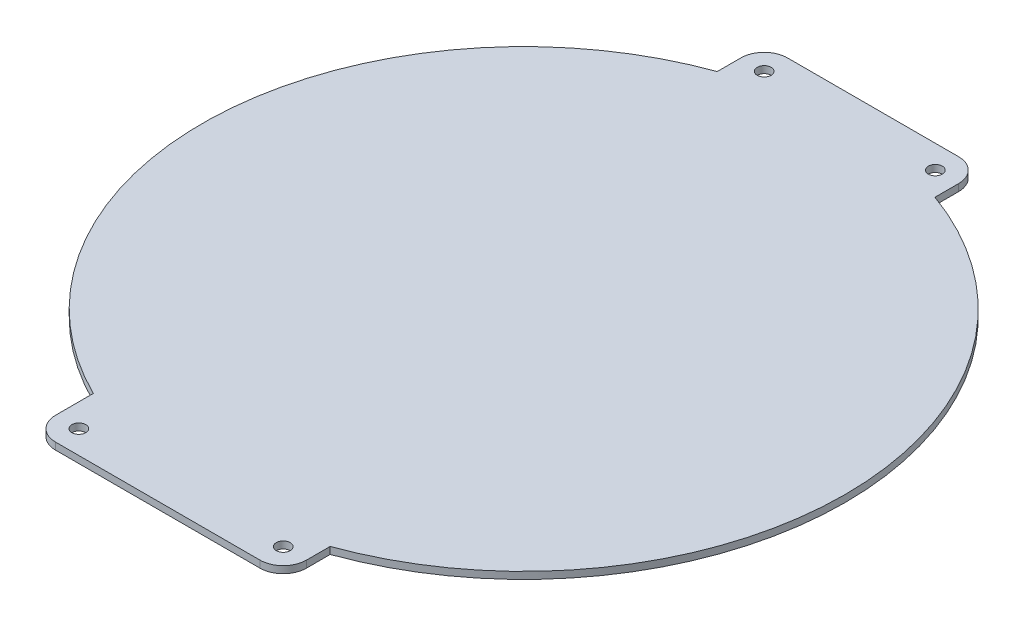
ISO-10303-21;
HEADER;
FILE_DESCRIPTION(('STEP AP214'),'2;1');
FILE_NAME('part.step','',(''),(''),'','','');
FILE_SCHEMA(('AUTOMOTIVE_DESIGN { 1 0 10303 214 1 1 1 1 }'));
ENDSEC;
DATA;
#1=APPLICATION_CONTEXT('core data for automotive mechanical design processes');
#2=APPLICATION_PROTOCOL_DEFINITION('international standard','automotive_design',2000,#1);
#3=PRODUCT_CONTEXT('',#1,'mechanical');
#4=PRODUCT('Part','Part','',(#3));
#5=PRODUCT_RELATED_PRODUCT_CATEGORY('part','',(#4));
#6=PRODUCT_DEFINITION_FORMATION('','',#4);
#7=PRODUCT_DEFINITION_CONTEXT('part definition',#1,'design');
#8=PRODUCT_DEFINITION('design','',#6,#7);
#9=PRODUCT_DEFINITION_SHAPE('','',#8);
#10=(LENGTH_UNIT() NAMED_UNIT(*) SI_UNIT(.MILLI.,.METRE.));
#11=(NAMED_UNIT(*) PLANE_ANGLE_UNIT() SI_UNIT($,.RADIAN.));
#12=(NAMED_UNIT(*) SI_UNIT($,.STERADIAN.) SOLID_ANGLE_UNIT());
#13=UNCERTAINTY_MEASURE_WITH_UNIT(LENGTH_MEASURE(1.E-05),#10,'distance_accuracy_value','');
#14=(GEOMETRIC_REPRESENTATION_CONTEXT(3) GLOBAL_UNCERTAINTY_ASSIGNED_CONTEXT((#13)) GLOBAL_UNIT_ASSIGNED_CONTEXT((#10,
#11,#12)) REPRESENTATION_CONTEXT('',''));
#15=CARTESIAN_POINT('',(0.,0.,0.));
#16=DIRECTION('',(0.,0.,1.));
#17=DIRECTION('',(1.,0.,0.));
#18=AXIS2_PLACEMENT_3D('',#15,#16,#17);
#19=CARTESIAN_POINT('',(31.1619048833757,11.5,92.001));
#20=DIRECTION('',(-1.,0.,0.));
#21=DIRECTION('',(0.,0.,1.));
#22=AXIS2_PLACEMENT_3D('',#19,#20,#21);
#23=PLANE('',#22);
#24=DIRECTION('',(0.,0.,-1.));
#25=VECTOR('',#24,1.);
#26=CARTESIAN_POINT('',(31.1619048833757,9.49999999999999,92.001));
#27=LINE('',#26,#25);
#28=CARTESIAN_POINT('',(31.1619048833757,9.49999999999999,-86.5617449225663));
#29=VERTEX_POINT('',#28);
#30=CARTESIAN_POINT('',(31.1619048833757,9.49999999999999,-93.3380951166243));
#31=VERTEX_POINT('',#30);
#32=EDGE_CURVE('E158',#29,#31,#27,.T.);
#33=ORIENTED_EDGE('',*,*,#32,.T.);
#34=DIRECTION('',(0.,-1.,0.));
#35=VECTOR('',#34,1.);
#36=CARTESIAN_POINT('',(31.1619048833757,11.5,-93.3380951166243));
#37=LINE('',#36,#35);
#38=CARTESIAN_POINT('',(31.1619048833757,11.5,-93.3380951166243));
#39=VERTEX_POINT('',#38);
#40=EDGE_CURVE('E11',#39,#31,#37,.T.);
#41=ORIENTED_EDGE('',*,*,#40,.F.);
#42=DIRECTION('',(0.,0.,-1.));
#43=VECTOR('',#42,1.);
#44=CARTESIAN_POINT('',(31.1619048833757,11.5,92.001));
#45=LINE('',#44,#43);
#46=CARTESIAN_POINT('',(31.1619048833757,11.5,-86.5617449225663));
#47=VERTEX_POINT('',#46);
#48=EDGE_CURVE('E103',#47,#39,#45,.T.);
#49=ORIENTED_EDGE('',*,*,#48,.F.);
#50=DIRECTION('',(0.,-1.,0.));
#51=VECTOR('',#50,1.);
#52=CARTESIAN_POINT('',(31.1619048833757,11.5,-86.5617449225663));
#53=LINE('',#52,#51);
#54=EDGE_CURVE('E53',#47,#29,#53,.T.);
#55=ORIENTED_EDGE('',*,*,#54,.T.);
#56=EDGE_LOOP('',(#33,#41,#49,#55));
#57=FACE_BOUND('',#56,.T.);
#58=ADVANCED_FACE('F37',(#57),#23,.F.);
#59=CARTESIAN_POINT('',(24.5,11.5,-93.3380951166243));
#60=DIRECTION('',(0.,-1.,0.));
#61=DIRECTION('',(0.,0.,-1.));
#62=AXIS2_PLACEMENT_3D('',#59,#60,#61);
#63=CYLINDRICAL_SURFACE('',#62,6.6619048833757);
#64=CARTESIAN_POINT('',(24.5,9.49999999999999,-93.3380951166243));
#65=DIRECTION('',(0.,-1.,0.));
#66=DIRECTION('',(1.,0.,0.));
#67=AXIS2_PLACEMENT_3D('',#64,#65,#66);
#68=CIRCLE('',#67,6.6619048833757);
#69=CARTESIAN_POINT('',(24.5,9.5,-100.));
#70=VERTEX_POINT('',#69);
#71=EDGE_CURVE('E160',#70,#31,#68,.T.);
#72=ORIENTED_EDGE('',*,*,#71,.F.);
#73=DIRECTION('',(0.,-1.,0.));
#74=VECTOR('',#73,1.);
#75=CARTESIAN_POINT('',(24.5,11.5,-100.));
#76=LINE('',#75,#74);
#77=CARTESIAN_POINT('',(24.5,11.5,-100.));
#78=VERTEX_POINT('',#77);
#79=EDGE_CURVE('E45',#78,#70,#76,.T.);
#80=ORIENTED_EDGE('',*,*,#79,.F.);
#81=CARTESIAN_POINT('',(24.5,11.5,-93.3380951166243));
#82=DIRECTION('',(0.,-1.,0.));
#83=DIRECTION('',(1.,0.,0.));
#84=AXIS2_PLACEMENT_3D('',#81,#82,#83);
#85=CIRCLE('',#84,6.6619048833757);
#86=EDGE_CURVE('E230',#78,#39,#85,.T.);
#87=ORIENTED_EDGE('',*,*,#86,.T.);
#88=ORIENTED_EDGE('',*,*,#40,.T.);
#89=EDGE_LOOP('',(#72,#80,#87,#88));
#90=FACE_BOUND('',#89,.T.);
#91=ADVANCED_FACE('F215',(#90),#63,.T.);
#92=CARTESIAN_POINT('',(17.0000000000001,11.5,-100.));
#93=DIRECTION('',(0.,0.,1.));
#94=DIRECTION('',(1.,0.,0.));
#95=AXIS2_PLACEMENT_3D('',#92,#93,#94);
#96=PLANE('',#95);
#97=DIRECTION('',(-1.,0.,0.));
#98=VECTOR('',#97,1.);
#99=CARTESIAN_POINT('',(17.0000000000001,9.5,-100.));
#100=LINE('',#99,#98);
#101=CARTESIAN_POINT('',(-24.5,9.50000000000002,-100.));
#102=VERTEX_POINT('',#101);
#103=EDGE_CURVE('E164',#70,#102,#100,.T.);
#104=ORIENTED_EDGE('',*,*,#103,.T.);
#105=DIRECTION('',(0.,-1.,0.));
#106=VECTOR('',#105,1.);
#107=CARTESIAN_POINT('',(-24.5,11.5,-100.));
#108=LINE('',#107,#106);
#109=CARTESIAN_POINT('',(-24.5,11.5,-100.));
#110=VERTEX_POINT('',#109);
#111=EDGE_CURVE('E205',#110,#102,#108,.T.);
#112=ORIENTED_EDGE('',*,*,#111,.F.);
#113=DIRECTION('',(-1.,0.,0.));
#114=VECTOR('',#113,1.);
#115=CARTESIAN_POINT('',(17.0000000000001,11.5,-100.));
#116=LINE('',#115,#114);
#117=EDGE_CURVE('E212',#78,#110,#116,.T.);
#118=ORIENTED_EDGE('',*,*,#117,.F.);
#119=ORIENTED_EDGE('',*,*,#79,.T.);
#120=EDGE_LOOP('',(#104,#112,#118,#119));
#121=FACE_BOUND('',#120,.T.);
#122=ADVANCED_FACE('F210',(#121),#96,.F.);
#123=CARTESIAN_POINT('',(-24.5,11.5,-93.3380951166243));
#124=DIRECTION('',(0.,-1.,0.));
#125=DIRECTION('',(0.,0.,-1.));
#126=AXIS2_PLACEMENT_3D('',#123,#124,#125);
#127=CYLINDRICAL_SURFACE('',#126,6.6619048833757);
#128=CARTESIAN_POINT('',(-24.5,9.50000000000002,-93.3380951166243));
#129=DIRECTION('',(0.,-1.,0.));
#130=DIRECTION('',(1.,0.,0.));
#131=AXIS2_PLACEMENT_3D('',#128,#129,#130);
#132=CIRCLE('',#131,6.6619048833757);
#133=CARTESIAN_POINT('',(-31.1619048833757,9.50000000000003,-93.3380951166243));
#134=VERTEX_POINT('',#133);
#135=EDGE_CURVE('E167',#134,#102,#132,.T.);
#136=ORIENTED_EDGE('',*,*,#135,.F.);
#137=DIRECTION('',(0.,-1.,0.));
#138=VECTOR('',#137,1.);
#139=CARTESIAN_POINT('',(-31.1619048833757,11.5,-93.3380951166243));
#140=LINE('',#139,#138);
#141=CARTESIAN_POINT('',(-31.1619048833757,11.5,-93.3380951166243));
#142=VERTEX_POINT('',#141);
#143=EDGE_CURVE('E203',#142,#134,#140,.T.);
#144=ORIENTED_EDGE('',*,*,#143,.F.);
#145=CARTESIAN_POINT('',(-24.5,11.5,-93.3380951166243));
#146=DIRECTION('',(0.,-1.,0.));
#147=DIRECTION('',(1.,0.,0.));
#148=AXIS2_PLACEMENT_3D('',#145,#146,#147);
#149=CIRCLE('',#148,6.6619048833757);
#150=EDGE_CURVE('E225',#142,#110,#149,.T.);
#151=ORIENTED_EDGE('',*,*,#150,.T.);
#152=ORIENTED_EDGE('',*,*,#111,.T.);
#153=EDGE_LOOP('',(#136,#144,#151,#152));
#154=FACE_BOUND('',#153,.T.);
#155=ADVANCED_FACE('F221',(#154),#127,.T.);
#156=CARTESIAN_POINT('',(-31.1619048833757,11.5,92.001));
#157=DIRECTION('',(1.,0.,0.));
#158=DIRECTION('',(0.,0.,-1.));
#159=AXIS2_PLACEMENT_3D('',#156,#157,#158);
#160=PLANE('',#159);
#161=DIRECTION('',(0.,0.,1.));
#162=VECTOR('',#161,1.);
#163=CARTESIAN_POINT('',(-31.1619048833757,9.50000000000003,92.001));
#164=LINE('',#163,#162);
#165=CARTESIAN_POINT('',(-31.1619048833757,9.50000000000003,-86.5617449225664));
#166=VERTEX_POINT('',#165);
#167=EDGE_CURVE('E170',#134,#166,#164,.T.);
#168=ORIENTED_EDGE('',*,*,#167,.T.);
#169=DIRECTION('',(0.,-1.,0.));
#170=VECTOR('',#169,1.);
#171=CARTESIAN_POINT('',(-31.1619048833757,11.5,-86.5617449225664));
#172=LINE('',#171,#170);
#173=CARTESIAN_POINT('',(-31.1619048833757,11.5,-86.5617449225664));
#174=VERTEX_POINT('',#173);
#175=EDGE_CURVE('E201',#174,#166,#172,.T.);
#176=ORIENTED_EDGE('',*,*,#175,.F.);
#177=DIRECTION('',(0.,0.,1.));
#178=VECTOR('',#177,1.);
#179=CARTESIAN_POINT('',(-31.1619048833757,11.5,92.001));
#180=LINE('',#179,#178);
#181=EDGE_CURVE('E226',#142,#174,#180,.T.);
#182=ORIENTED_EDGE('',*,*,#181,.F.);
#183=ORIENTED_EDGE('',*,*,#143,.T.);
#184=EDGE_LOOP('',(#168,#176,#182,#183));
#185=FACE_BOUND('',#184,.T.);
#186=ADVANCED_FACE('F412',(#185),#160,.F.);
#187=CARTESIAN_POINT('',(0.,11.5,0.));
#188=DIRECTION('',(0.,-1.,0.));
#189=DIRECTION('',(0.,0.,-1.));
#190=AXIS2_PLACEMENT_3D('',#187,#188,#189);
#191=CYLINDRICAL_SURFACE('',#190,92.);
#192=CARTESIAN_POINT('',(0.,9.50000000000001,0.));
#193=DIRECTION('',(0.,-1.,0.));
#194=DIRECTION('',(1.,0.,0.));
#195=AXIS2_PLACEMENT_3D('',#192,#193,#194);
#196=CIRCLE('',#195,92.);
#197=CARTESIAN_POINT('',(-40.6619048833756,9.50000000000003,82.5264169297039));
#198=VERTEX_POINT('',#197);
#199=EDGE_CURVE('E173',#198,#166,#196,.T.);
#200=ORIENTED_EDGE('',*,*,#199,.F.);
#201=DIRECTION('',(0.,-1.,0.));
#202=VECTOR('',#201,1.);
#203=CARTESIAN_POINT('',(-40.6619048833756,11.5,82.5264169297039));
#204=LINE('',#203,#202);
#205=CARTESIAN_POINT('',(-40.6619048833756,11.5,82.5264169297039));
#206=VERTEX_POINT('',#205);
#207=EDGE_CURVE('E199',#206,#198,#204,.T.);
#208=ORIENTED_EDGE('',*,*,#207,.F.);
#209=CARTESIAN_POINT('',(0.,11.5,0.));
#210=DIRECTION('',(0.,-1.,0.));
#211=DIRECTION('',(1.,0.,0.));
#212=AXIS2_PLACEMENT_3D('',#209,#210,#211);
#213=CIRCLE('',#212,92.);
#214=EDGE_CURVE('E228',#206,#174,#213,.T.);
#215=ORIENTED_EDGE('',*,*,#214,.T.);
#216=ORIENTED_EDGE('',*,*,#175,.T.);
#217=EDGE_LOOP('',(#200,#208,#215,#216));
#218=FACE_BOUND('',#217,.T.);
#219=ADVANCED_FACE('F403',(#218),#191,.T.);
#220=CARTESIAN_POINT('',(-40.6619048833756,11.5,92.001));
#221=DIRECTION('',(1.,0.,0.));
#222=DIRECTION('',(0.,0.,-1.));
#223=AXIS2_PLACEMENT_3D('',#220,#221,#222);
#224=PLANE('',#223);
#225=DIRECTION('',(0.,0.,1.));
#226=VECTOR('',#225,1.);
#227=CARTESIAN_POINT('',(-40.6619048833756,9.50000000000003,92.001));
#228=LINE('',#227,#226);
#229=CARTESIAN_POINT('',(-40.6619048833756,9.50000000000003,93.3380951166243));
#230=VERTEX_POINT('',#229);
#231=EDGE_CURVE('E176',#198,#230,#228,.T.);
#232=ORIENTED_EDGE('',*,*,#231,.T.);
#233=DIRECTION('',(0.,-1.,0.));
#234=VECTOR('',#233,1.);
#235=CARTESIAN_POINT('',(-40.6619048833756,11.5,93.3380951166243));
#236=LINE('',#235,#234);
#237=CARTESIAN_POINT('',(-40.6619048833756,11.5,93.3380951166243));
#238=VERTEX_POINT('',#237);
#239=EDGE_CURVE('E197',#238,#230,#236,.T.);
#240=ORIENTED_EDGE('',*,*,#239,.F.);
#241=DIRECTION('',(0.,0.,1.));
#242=VECTOR('',#241,1.);
#243=CARTESIAN_POINT('',(-40.6619048833756,11.5,92.001));
#244=LINE('',#243,#242);
#245=EDGE_CURVE('E236',#206,#238,#244,.T.);
#246=ORIENTED_EDGE('',*,*,#245,.F.);
#247=ORIENTED_EDGE('',*,*,#207,.T.);
#248=EDGE_LOOP('',(#232,#240,#246,#247));
#249=FACE_BOUND('',#248,.T.);
#250=ADVANCED_FACE('F245',(#249),#224,.F.);
#251=CARTESIAN_POINT('',(-33.9999999999999,11.5,93.3380951166243));
#252=DIRECTION('',(0.,-1.,0.));
#253=DIRECTION('',(0.,0.,-1.));
#254=AXIS2_PLACEMENT_3D('',#251,#252,#253);
#255=CYLINDRICAL_SURFACE('',#254,6.66190488337571);
#256=CARTESIAN_POINT('',(-33.9999999999999,9.50000000000003,93.3380951166243));
#257=DIRECTION('',(0.,-1.,0.));
#258=DIRECTION('',(1.,0.,0.));
#259=AXIS2_PLACEMENT_3D('',#256,#257,#258);
#260=CIRCLE('',#259,6.66190488337571);
#261=CARTESIAN_POINT('',(-33.9999999999999,9.50000000000003,100.));
#262=VERTEX_POINT('',#261);
#263=EDGE_CURVE('E179',#262,#230,#260,.T.);
#264=ORIENTED_EDGE('',*,*,#263,.F.);
#265=DIRECTION('',(0.,-1.,0.));
#266=VECTOR('',#265,1.);
#267=CARTESIAN_POINT('',(-33.9999999999999,11.5,100.));
#268=LINE('',#267,#266);
#269=CARTESIAN_POINT('',(-33.9999999999999,11.5,100.));
#270=VERTEX_POINT('',#269);
#271=EDGE_CURVE('E194',#270,#262,#268,.T.);
#272=ORIENTED_EDGE('',*,*,#271,.F.);
#273=CARTESIAN_POINT('',(-33.9999999999999,11.5,93.3380951166243));
#274=DIRECTION('',(0.,-1.,0.));
#275=DIRECTION('',(1.,0.,0.));
#276=AXIS2_PLACEMENT_3D('',#273,#274,#275);
#277=CIRCLE('',#276,6.66190488337571);
#278=EDGE_CURVE('E153',#270,#238,#277,.T.);
#279=ORIENTED_EDGE('',*,*,#278,.T.);
#280=ORIENTED_EDGE('',*,*,#239,.T.);
#281=EDGE_LOOP('',(#264,#272,#279,#280));
#282=FACE_BOUND('',#281,.T.);
#283=ADVANCED_FACE('F240',(#282),#255,.T.);
#284=CARTESIAN_POINT('',(17.0000000000001,11.5,100.));
#285=DIRECTION('',(0.,0.,-1.));
#286=DIRECTION('',(-1.,0.,0.));
#287=AXIS2_PLACEMENT_3D('',#284,#285,#286);
#288=PLANE('',#287);
#289=DIRECTION('',(1.,0.,0.));
#290=VECTOR('',#289,1.);
#291=CARTESIAN_POINT('',(17.0000000000001,9.5,100.));
#292=LINE('',#291,#290);
#293=CARTESIAN_POINT('',(24.5,9.49999999999999,100.));
#294=VERTEX_POINT('',#293);
#295=EDGE_CURVE('E182',#262,#294,#292,.T.);
#296=ORIENTED_EDGE('',*,*,#295,.T.);
#297=DIRECTION('',(0.,-1.,0.));
#298=VECTOR('',#297,1.);
#299=CARTESIAN_POINT('',(24.5,11.5,100.));
#300=LINE('',#299,#298);
#301=CARTESIAN_POINT('',(24.5,11.5,100.));
#302=VERTEX_POINT('',#301);
#303=EDGE_CURVE('E141',#302,#294,#300,.T.);
#304=ORIENTED_EDGE('',*,*,#303,.F.);
#305=DIRECTION('',(1.,0.,0.));
#306=VECTOR('',#305,1.);
#307=CARTESIAN_POINT('',(17.0000000000001,11.5,100.));
#308=LINE('',#307,#306);
#309=EDGE_CURVE('E150',#270,#302,#308,.T.);
#310=ORIENTED_EDGE('',*,*,#309,.F.);
#311=ORIENTED_EDGE('',*,*,#271,.T.);
#312=EDGE_LOOP('',(#296,#304,#310,#311));
#313=FACE_BOUND('',#312,.T.);
#314=ADVANCED_FACE('F249',(#313),#288,.F.);
#315=CARTESIAN_POINT('',(24.5000000000001,11.5,93.3380951166243));
#316=DIRECTION('',(0.,-1.,0.));
#317=DIRECTION('',(0.,0.,-1.));
#318=AXIS2_PLACEMENT_3D('',#315,#316,#317);
#319=CYLINDRICAL_SURFACE('',#318,6.6619048833757);
#320=CARTESIAN_POINT('',(24.5000000000001,9.49999999999999,93.3380951166243));
#321=DIRECTION('',(0.,-1.,0.));
#322=DIRECTION('',(1.,0.,0.));
#323=AXIS2_PLACEMENT_3D('',#320,#321,#322);
#324=CIRCLE('',#323,6.6619048833757);
#325=CARTESIAN_POINT('',(31.1619048833758,9.49999999999999,93.3380951166243));
#326=VERTEX_POINT('',#325);
#327=EDGE_CURVE('E138',#326,#294,#324,.T.);
#328=ORIENTED_EDGE('',*,*,#327,.F.);
#329=DIRECTION('',(0.,-1.,0.));
#330=VECTOR('',#329,1.);
#331=CARTESIAN_POINT('',(31.1619048833758,11.5,93.3380951166243));
#332=LINE('',#331,#330);
#333=CARTESIAN_POINT('',(31.1619048833758,11.5,93.3380951166243));
#334=VERTEX_POINT('',#333);
#335=EDGE_CURVE('E132',#334,#326,#332,.T.);
#336=ORIENTED_EDGE('',*,*,#335,.F.);
#337=CARTESIAN_POINT('',(24.5000000000001,11.5,93.3380951166243));
#338=DIRECTION('',(0.,-1.,0.));
#339=DIRECTION('',(1.,0.,0.));
#340=AXIS2_PLACEMENT_3D('',#337,#338,#339);
#341=CIRCLE('',#340,6.6619048833757);
#342=EDGE_CURVE('E136',#334,#302,#341,.T.);
#343=ORIENTED_EDGE('',*,*,#342,.T.);
#344=ORIENTED_EDGE('',*,*,#303,.T.);
#345=EDGE_LOOP('',(#328,#336,#343,#344));
#346=FACE_BOUND('',#345,.T.);
#347=ADVANCED_FACE('F134',(#346),#319,.T.);
#348=CARTESIAN_POINT('',(31.1619048833758,11.5,92.001));
#349=DIRECTION('',(-1.,0.,0.));
#350=DIRECTION('',(0.,0.,1.));
#351=AXIS2_PLACEMENT_3D('',#348,#349,#350);
#352=PLANE('',#351);
#353=DIRECTION('',(0.,0.,-1.));
#354=VECTOR('',#353,1.);
#355=CARTESIAN_POINT('',(31.1619048833758,9.49999999999999,92.001));
#356=LINE('',#355,#354);
#357=CARTESIAN_POINT('',(31.1619048833758,9.49999999999999,86.5617449225663));
#358=VERTEX_POINT('',#357);
#359=EDGE_CURVE('E186',#326,#358,#356,.T.);
#360=ORIENTED_EDGE('',*,*,#359,.T.);
#361=DIRECTION('',(0.,-1.,0.));
#362=VECTOR('',#361,1.);
#363=CARTESIAN_POINT('',(31.1619048833758,11.5,86.5617449225663));
#364=LINE('',#363,#362);
#365=CARTESIAN_POINT('',(31.1619048833758,11.5,86.5617449225663));
#366=VERTEX_POINT('',#365);
#367=EDGE_CURVE('E91',#366,#358,#364,.T.);
#368=ORIENTED_EDGE('',*,*,#367,.F.);
#369=DIRECTION('',(0.,0.,-1.));
#370=VECTOR('',#369,1.);
#371=CARTESIAN_POINT('',(31.1619048833758,11.5,92.001));
#372=LINE('',#371,#370);
#373=EDGE_CURVE('E143',#334,#366,#372,.T.);
#374=ORIENTED_EDGE('',*,*,#373,.F.);
#375=ORIENTED_EDGE('',*,*,#335,.T.);
#376=EDGE_LOOP('',(#360,#368,#374,#375));
#377=FACE_BOUND('',#376,.T.);
#378=ADVANCED_FACE('F144',(#377),#352,.F.);
#379=CARTESIAN_POINT('',(0.,11.5,0.));
#380=DIRECTION('',(0.,-1.,0.));
#381=DIRECTION('',(0.,0.,-1.));
#382=AXIS2_PLACEMENT_3D('',#379,#380,#381);
#383=CYLINDRICAL_SURFACE('',#382,92.);
#384=CARTESIAN_POINT('',(0.,9.50000000000001,0.));
#385=DIRECTION('',(0.,-1.,0.));
#386=DIRECTION('',(1.,0.,0.));
#387=AXIS2_PLACEMENT_3D('',#384,#385,#386);
#388=CIRCLE('',#387,92.);
#389=EDGE_CURVE('E188',#29,#358,#388,.T.);
#390=ORIENTED_EDGE('',*,*,#389,.F.);
#391=ORIENTED_EDGE('',*,*,#54,.F.);
#392=CARTESIAN_POINT('',(0.,11.5,0.));
#393=DIRECTION('',(0.,-1.,0.));
#394=DIRECTION('',(1.,0.,0.));
#395=AXIS2_PLACEMENT_3D('',#392,#393,#394);
#396=CIRCLE('',#395,92.);
#397=EDGE_CURVE('E145',#47,#366,#396,.T.);
#398=ORIENTED_EDGE('',*,*,#397,.T.);
#399=ORIENTED_EDGE('',*,*,#367,.T.);
#400=EDGE_LOOP('',(#390,#391,#398,#399));
#401=FACE_BOUND('',#400,.T.);
#402=ADVANCED_FACE('F320',(#401),#383,.T.);
#403=CARTESIAN_POINT('',(24.5,11.5,-93.3380951166243));
#404=DIRECTION('',(0.,-1.,0.));
#405=DIRECTION('',(1.,0.,0.));
#406=AXIS2_PLACEMENT_3D('',#403,#404,#405);
#407=PLANE('',#406);
#408=CARTESIAN_POINT('',(-33.9999999999999,11.5,93.3380951166243));
#409=DIRECTION('',(0.,-1.,0.));
#410=DIRECTION('',(1.,0.,0.));
#411=AXIS2_PLACEMENT_3D('',#408,#409,#410);
#412=CIRCLE('',#411,2.);
#413=CARTESIAN_POINT('',(-33.9999999999999,11.5,91.3380951166243));
#414=VERTEX_POINT('',#413);
#415=EDGE_CURVE('E279',#414,#414,#412,.T.);
#416=ORIENTED_EDGE('',*,*,#415,.T.);
#417=EDGE_LOOP('',(#416));
#418=FACE_BOUND('',#417,.T.);
#419=CARTESIAN_POINT('',(24.5000000000001,11.5,93.3380951166243));
#420=DIRECTION('',(0.,-1.,0.));
#421=DIRECTION('',(1.,0.,0.));
#422=AXIS2_PLACEMENT_3D('',#419,#420,#421);
#423=CIRCLE('',#422,2.00000000000001);
#424=CARTESIAN_POINT('',(24.5000000000001,11.5,91.3380951166243));
#425=VERTEX_POINT('',#424);
#426=EDGE_CURVE('E273',#425,#425,#423,.T.);
#427=ORIENTED_EDGE('',*,*,#426,.T.);
#428=EDGE_LOOP('',(#427));
#429=FACE_BOUND('',#428,.T.);
#430=CARTESIAN_POINT('',(24.5,11.5,-93.3380951166243));
#431=DIRECTION('',(0.,-1.,0.));
#432=DIRECTION('',(1.,0.,0.));
#433=AXIS2_PLACEMENT_3D('',#430,#431,#432);
#434=CIRCLE('',#433,2.);
#435=CARTESIAN_POINT('',(24.5,11.5,-95.3380951166243));
#436=VERTEX_POINT('',#435);
#437=EDGE_CURVE('E267',#436,#436,#434,.T.);
#438=ORIENTED_EDGE('',*,*,#437,.T.);
#439=EDGE_LOOP('',(#438));
#440=FACE_BOUND('',#439,.T.);
#441=CARTESIAN_POINT('',(-24.5,11.5,-93.3380951166243));
#442=DIRECTION('',(0.,-1.,0.));
#443=DIRECTION('',(1.,0.,0.));
#444=AXIS2_PLACEMENT_3D('',#441,#442,#443);
#445=CIRCLE('',#444,2.);
#446=CARTESIAN_POINT('',(-24.5,11.5,-95.3380951166243));
#447=VERTEX_POINT('',#446);
#448=EDGE_CURVE('E161',#447,#447,#445,.T.);
#449=ORIENTED_EDGE('',*,*,#448,.T.);
#450=EDGE_LOOP('',(#449));
#451=FACE_BOUND('',#450,.T.);
#452=ORIENTED_EDGE('',*,*,#48,.T.);
#453=ORIENTED_EDGE('',*,*,#86,.F.);
#454=ORIENTED_EDGE('',*,*,#117,.T.);
#455=ORIENTED_EDGE('',*,*,#150,.F.);
#456=ORIENTED_EDGE('',*,*,#181,.T.);
#457=ORIENTED_EDGE('',*,*,#214,.F.);
#458=ORIENTED_EDGE('',*,*,#245,.T.);
#459=ORIENTED_EDGE('',*,*,#278,.F.);
#460=ORIENTED_EDGE('',*,*,#309,.T.);
#461=ORIENTED_EDGE('',*,*,#342,.F.);
#462=ORIENTED_EDGE('',*,*,#373,.T.);
#463=ORIENTED_EDGE('',*,*,#397,.F.);
#464=EDGE_LOOP('',(#452,#453,#454,#455,#456,#457,#458,#459,#460,#461,#462,#463));
#465=FACE_BOUND('',#464,.T.);
#466=ADVANCED_FACE('F147',(#418,#429,#440,#451,#465),#407,.F.);
#467=CARTESIAN_POINT('',(24.5,9.49999999999999,-93.3380951166243));
#468=DIRECTION('',(0.,-1.,0.));
#469=DIRECTION('',(1.,0.,0.));
#470=AXIS2_PLACEMENT_3D('',#467,#468,#469);
#471=PLANE('',#470);
#472=CARTESIAN_POINT('',(-33.9999999999999,9.50000000000003,93.3380951166243));
#473=DIRECTION('',(0.,-1.,0.));
#474=DIRECTION('',(1.,0.,0.));
#475=AXIS2_PLACEMENT_3D('',#472,#473,#474);
#476=CIRCLE('',#475,2.);
#477=CARTESIAN_POINT('',(-33.9999999999999,9.50000000000003,91.3380951166243));
#478=VERTEX_POINT('',#477);
#479=EDGE_CURVE('E282',#478,#478,#476,.T.);
#480=ORIENTED_EDGE('',*,*,#479,.F.);
#481=EDGE_LOOP('',(#480));
#482=FACE_BOUND('',#481,.T.);
#483=CARTESIAN_POINT('',(24.5000000000001,9.49999999999999,93.3380951166243));
#484=DIRECTION('',(0.,-1.,0.));
#485=DIRECTION('',(1.,0.,0.));
#486=AXIS2_PLACEMENT_3D('',#483,#484,#485);
#487=CIRCLE('',#486,2.00000000000001);
#488=CARTESIAN_POINT('',(24.5000000000001,9.49999999999999,91.3380951166243));
#489=VERTEX_POINT('',#488);
#490=EDGE_CURVE('E276',#489,#489,#487,.T.);
#491=ORIENTED_EDGE('',*,*,#490,.F.);
#492=EDGE_LOOP('',(#491));
#493=FACE_BOUND('',#492,.T.);
#494=CARTESIAN_POINT('',(24.5,9.49999999999999,-93.3380951166243));
#495=DIRECTION('',(0.,-1.,0.));
#496=DIRECTION('',(1.,0.,0.));
#497=AXIS2_PLACEMENT_3D('',#494,#495,#496);
#498=CIRCLE('',#497,2.);
#499=CARTESIAN_POINT('',(24.5,9.49999999999999,-95.3380951166243));
#500=VERTEX_POINT('',#499);
#501=EDGE_CURVE('E270',#500,#500,#498,.T.);
#502=ORIENTED_EDGE('',*,*,#501,.F.);
#503=EDGE_LOOP('',(#502));
#504=FACE_BOUND('',#503,.T.);
#505=CARTESIAN_POINT('',(-24.5,9.50000000000002,-93.3380951166243));
#506=DIRECTION('',(0.,-1.,0.));
#507=DIRECTION('',(1.,0.,0.));
#508=AXIS2_PLACEMENT_3D('',#505,#506,#507);
#509=CIRCLE('',#508,2.);
#510=CARTESIAN_POINT('',(-24.5,9.50000000000003,-95.3380951166243));
#511=VERTEX_POINT('',#510);
#512=EDGE_CURVE('E264',#511,#511,#509,.T.);
#513=ORIENTED_EDGE('',*,*,#512,.F.);
#514=EDGE_LOOP('',(#513));
#515=FACE_BOUND('',#514,.T.);
#516=ORIENTED_EDGE('',*,*,#32,.F.);
#517=ORIENTED_EDGE('',*,*,#389,.T.);
#518=ORIENTED_EDGE('',*,*,#359,.F.);
#519=ORIENTED_EDGE('',*,*,#327,.T.);
#520=ORIENTED_EDGE('',*,*,#295,.F.);
#521=ORIENTED_EDGE('',*,*,#263,.T.);
#522=ORIENTED_EDGE('',*,*,#231,.F.);
#523=ORIENTED_EDGE('',*,*,#199,.T.);
#524=ORIENTED_EDGE('',*,*,#167,.F.);
#525=ORIENTED_EDGE('',*,*,#135,.T.);
#526=ORIENTED_EDGE('',*,*,#103,.F.);
#527=ORIENTED_EDGE('',*,*,#71,.T.);
#528=EDGE_LOOP('',(#516,#517,#518,#519,#520,#521,#522,#523,#524,#525,#526,#527));
#529=FACE_BOUND('',#528,.T.);
#530=ADVANCED_FACE('F217',(#482,#493,#504,#515,#529),#471,.T.);
#531=CARTESIAN_POINT('',(-24.5,11.5,-93.3380951166243));
#532=DIRECTION('',(0.,-1.,0.));
#533=DIRECTION('',(0.,0.,-1.));
#534=AXIS2_PLACEMENT_3D('',#531,#532,#533);
#535=CYLINDRICAL_SURFACE('',#534,2.);
#536=CARTESIAN_POINT('',(-24.5,11.5,-95.3380951166243));
#537=CARTESIAN_POINT('',(-24.5,11.4791666666667,-95.3380951166243));
#538=CARTESIAN_POINT('',(-24.5,11.4583333333334,-95.3380951166243));
#539=CARTESIAN_POINT('',(-24.5,11.4166666666667,-95.3380951166243));
#540=CARTESIAN_POINT('',(-24.5,11.3958333333334,-95.3380951166243));
#541=CARTESIAN_POINT('',(-24.5,11.3541666666667,-95.3380951166243));
#542=CARTESIAN_POINT('',(-24.5,11.3333333333334,-95.3380951166243));
#543=CARTESIAN_POINT('',(-24.5,11.2916666666667,-95.3380951166243));
#544=CARTESIAN_POINT('',(-24.5,11.2708333333334,-95.3380951166243));
#545=CARTESIAN_POINT('',(-24.5,11.2291666666667,-95.3380951166243));
#546=CARTESIAN_POINT('',(-24.5,11.2083333333334,-95.3380951166243));
#547=CARTESIAN_POINT('',(-24.5,11.1666666666667,-95.3380951166243));
#548=CARTESIAN_POINT('',(-24.5,11.1458333333334,-95.3380951166243));
#549=CARTESIAN_POINT('',(-24.5,11.1041666666667,-95.3380951166243));
#550=CARTESIAN_POINT('',(-24.5,11.0833333333334,-95.3380951166243));
#551=CARTESIAN_POINT('',(-24.5,11.0416666666667,-95.3380951166243));
#552=CARTESIAN_POINT('',(-24.5,11.0208333333334,-95.3380951166243));
#553=CARTESIAN_POINT('',(-24.5,10.9791666666667,-95.3380951166243));
#554=CARTESIAN_POINT('',(-24.5,10.9583333333334,-95.3380951166243));
#555=CARTESIAN_POINT('',(-24.5,10.9166666666667,-95.3380951166243));
#556=CARTESIAN_POINT('',(-24.5,10.8958333333334,-95.3380951166243));
#557=CARTESIAN_POINT('',(-24.5,10.8541666666667,-95.3380951166243));
#558=CARTESIAN_POINT('',(-24.5,10.8333333333334,-95.3380951166243));
#559=CARTESIAN_POINT('',(-24.5,10.7916666666667,-95.3380951166243));
#560=CARTESIAN_POINT('',(-24.5,10.7708333333334,-95.3380951166243));
#561=CARTESIAN_POINT('',(-24.5,10.7291666666667,-95.3380951166243));
#562=CARTESIAN_POINT('',(-24.5,10.7083333333334,-95.3380951166243));
#563=CARTESIAN_POINT('',(-24.5,10.6666666666667,-95.3380951166243));
#564=CARTESIAN_POINT('',(-24.5,10.6458333333334,-95.3380951166243));
#565=CARTESIAN_POINT('',(-24.5,10.6041666666667,-95.3380951166243));
#566=CARTESIAN_POINT('',(-24.5,10.5833333333334,-95.3380951166243));
#567=CARTESIAN_POINT('',(-24.5,10.5416666666667,-95.3380951166243));
#568=CARTESIAN_POINT('',(-24.5,10.5208333333334,-95.3380951166243));
#569=CARTESIAN_POINT('',(-24.5,10.4791666666667,-95.3380951166243));
#570=CARTESIAN_POINT('',(-24.5,10.4583333333334,-95.3380951166243));
#571=CARTESIAN_POINT('',(-24.5,10.4166666666667,-95.3380951166243));
#572=CARTESIAN_POINT('',(-24.5,10.3958333333334,-95.3380951166243));
#573=CARTESIAN_POINT('',(-24.5,10.3541666666667,-95.3380951166243));
#574=CARTESIAN_POINT('',(-24.5,10.3333333333334,-95.3380951166243));
#575=CARTESIAN_POINT('',(-24.5,10.2916666666667,-95.3380951166243));
#576=CARTESIAN_POINT('',(-24.5,10.2708333333334,-95.3380951166243));
#577=CARTESIAN_POINT('',(-24.5,10.2291666666667,-95.3380951166243));
#578=CARTESIAN_POINT('',(-24.5,10.2083333333334,-95.3380951166243));
#579=CARTESIAN_POINT('',(-24.5,10.1666666666667,-95.3380951166243));
#580=CARTESIAN_POINT('',(-24.5,10.1458333333334,-95.3380951166243));
#581=CARTESIAN_POINT('',(-24.5,10.1041666666667,-95.3380951166243));
#582=CARTESIAN_POINT('',(-24.5,10.0833333333334,-95.3380951166243));
#583=CARTESIAN_POINT('',(-24.5,10.0416666666667,-95.3380951166243));
#584=CARTESIAN_POINT('',(-24.5,10.0208333333334,-95.3380951166243));
#585=CARTESIAN_POINT('',(-24.5,9.97916666666669,-95.3380951166243));
#586=CARTESIAN_POINT('',(-24.5,9.95833333333336,-95.3380951166243));
#587=CARTESIAN_POINT('',(-24.5,9.91666666666669,-95.3380951166243));
#588=CARTESIAN_POINT('',(-24.5,9.89583333333336,-95.3380951166243));
#589=CARTESIAN_POINT('',(-24.5,9.85416666666669,-95.3380951166243));
#590=CARTESIAN_POINT('',(-24.5,9.83333333333336,-95.3380951166243));
#591=CARTESIAN_POINT('',(-24.5,9.79166666666669,-95.3380951166243));
#592=CARTESIAN_POINT('',(-24.5,9.77083333333336,-95.3380951166243));
#593=CARTESIAN_POINT('',(-24.5,9.72916666666669,-95.3380951166243));
#594=CARTESIAN_POINT('',(-24.5,9.70833333333336,-95.3380951166243));
#595=CARTESIAN_POINT('',(-24.5,9.66666666666669,-95.3380951166243));
#596=CARTESIAN_POINT('',(-24.5,9.64583333333336,-95.3380951166243));
#597=CARTESIAN_POINT('',(-24.5,9.60416666666669,-95.3380951166243));
#598=CARTESIAN_POINT('',(-24.5,9.58333333333336,-95.3380951166243));
#599=CARTESIAN_POINT('',(-24.5,9.54166666666669,-95.3380951166243));
#600=CARTESIAN_POINT('',(-24.5,9.52083333333336,-95.3380951166243));
#601=CARTESIAN_POINT('',(-24.5,9.50000000000003,-95.3380951166243));
#602=B_SPLINE_CURVE_WITH_KNOTS('',3,(#536,#537,#538,#539,#540,#541,#542,#543,#544,#545,#546,
#547,#548,#549,#550,#551,#552,#553,#554,#555,#556,#557,#558,#559,#560,#561,#562,#563,#564,#565,
#566,#567,#568,#569,#570,#571,#572,#573,#574,#575,#576,#577,#578,#579,#580,#581,#582,#583,#584,
#585,#586,#587,#588,#589,#590,#591,#592,#593,#594,#595,#596,#597,#598,#599,#600,#601),
.UNSPECIFIED.,.F.,.F.,(4,2,2,2,2,2,2,2,2,2,2,2,2,2,2,2,2,2,2,2,2,2,2,2,2,2,2,2,2,2,2,2,4),(0.,
0.0624999999999983,0.124999999999998,0.187499999999998,0.249999999999999,0.312499999999999,
0.374999999999999,0.437499999999999,0.499999999999999,0.562499999999999,0.624999999999999,
0.687499999999999,0.749999999999999,0.812499999999999,0.874999999999999,0.937499999999999,
0.999999999999999,1.0625,1.125,1.1875,1.25,1.3125,1.375,1.4375,1.5,1.5625,1.625,1.6875,1.75,
1.8125,1.875,1.9375,2.),.UNSPECIFIED.);
#603=EDGE_CURVE('BSEAM299',#447,#511,#602,.T.);
#604=ORIENTED_EDGE('',*,*,#448,.F.);
#605=ORIENTED_EDGE('',*,*,#512,.T.);
#606=ORIENTED_EDGE('',*,*,#603,.T.);
#607=ORIENTED_EDGE('',*,*,#603,.F.);
#608=EDGE_LOOP('',(#604,#606,#605,#607));
#609=FACE_BOUND('',#608,.T.);
#610=ADVANCED_FACE('F299',(#609),#535,.F.);
#611=CARTESIAN_POINT('',(24.5,11.5,-93.3380951166243));
#612=DIRECTION('',(0.,-1.,0.));
#613=DIRECTION('',(0.,0.,-1.));
#614=AXIS2_PLACEMENT_3D('',#611,#612,#613);
#615=CYLINDRICAL_SURFACE('',#614,2.);
#616=CARTESIAN_POINT('',(24.5,11.5,-95.3380951166243));
#617=CARTESIAN_POINT('',(24.5,11.4791666666667,-95.3380951166243));
#618=CARTESIAN_POINT('',(24.5,11.4583333333333,-95.3380951166243));
#619=CARTESIAN_POINT('',(24.5,11.4166666666667,-95.3380951166243));
#620=CARTESIAN_POINT('',(24.5,11.3958333333333,-95.3380951166243));
#621=CARTESIAN_POINT('',(24.5,11.3541666666667,-95.3380951166243));
#622=CARTESIAN_POINT('',(24.5,11.3333333333333,-95.3380951166243));
#623=CARTESIAN_POINT('',(24.5,11.2916666666667,-95.3380951166243));
#624=CARTESIAN_POINT('',(24.5,11.2708333333333,-95.3380951166243));
#625=CARTESIAN_POINT('',(24.5,11.2291666666667,-95.3380951166243));
#626=CARTESIAN_POINT('',(24.5,11.2083333333333,-95.3380951166243));
#627=CARTESIAN_POINT('',(24.5,11.1666666666667,-95.3380951166243));
#628=CARTESIAN_POINT('',(24.5,11.1458333333333,-95.3380951166243));
#629=CARTESIAN_POINT('',(24.5,11.1041666666667,-95.3380951166243));
#630=CARTESIAN_POINT('',(24.5,11.0833333333333,-95.3380951166243));
#631=CARTESIAN_POINT('',(24.5,11.0416666666667,-95.3380951166243));
#632=CARTESIAN_POINT('',(24.5,11.0208333333333,-95.3380951166243));
#633=CARTESIAN_POINT('',(24.5,10.9791666666667,-95.3380951166243));
#634=CARTESIAN_POINT('',(24.5,10.9583333333333,-95.3380951166243));
#635=CARTESIAN_POINT('',(24.5,10.9166666666667,-95.3380951166243));
#636=CARTESIAN_POINT('',(24.5,10.8958333333333,-95.3380951166243));
#637=CARTESIAN_POINT('',(24.5,10.8541666666667,-95.3380951166243));
#638=CARTESIAN_POINT('',(24.5,10.8333333333333,-95.3380951166243));
#639=CARTESIAN_POINT('',(24.5,10.7916666666667,-95.3380951166243));
#640=CARTESIAN_POINT('',(24.5,10.7708333333333,-95.3380951166243));
#641=CARTESIAN_POINT('',(24.5,10.7291666666667,-95.3380951166243));
#642=CARTESIAN_POINT('',(24.5,10.7083333333333,-95.3380951166243));
#643=CARTESIAN_POINT('',(24.5,10.6666666666667,-95.3380951166243));
#644=CARTESIAN_POINT('',(24.5,10.6458333333333,-95.3380951166243));
#645=CARTESIAN_POINT('',(24.5,10.6041666666667,-95.3380951166243));
#646=CARTESIAN_POINT('',(24.5,10.5833333333333,-95.3380951166243));
#647=CARTESIAN_POINT('',(24.5,10.5416666666667,-95.3380951166243));
#648=CARTESIAN_POINT('',(24.5,10.5208333333333,-95.3380951166243));
#649=CARTESIAN_POINT('',(24.5,10.4791666666667,-95.3380951166243));
#650=CARTESIAN_POINT('',(24.5,10.4583333333333,-95.3380951166243));
#651=CARTESIAN_POINT('',(24.5,10.4166666666667,-95.3380951166243));
#652=CARTESIAN_POINT('',(24.5,10.3958333333333,-95.3380951166243));
#653=CARTESIAN_POINT('',(24.5,10.3541666666667,-95.3380951166243));
#654=CARTESIAN_POINT('',(24.5,10.3333333333333,-95.3380951166243));
#655=CARTESIAN_POINT('',(24.5,10.2916666666667,-95.3380951166243));
#656=CARTESIAN_POINT('',(24.5,10.2708333333333,-95.3380951166243));
#657=CARTESIAN_POINT('',(24.5,10.2291666666667,-95.3380951166243));
#658=CARTESIAN_POINT('',(24.5,10.2083333333333,-95.3380951166243));
#659=CARTESIAN_POINT('',(24.5,10.1666666666667,-95.3380951166243));
#660=CARTESIAN_POINT('',(24.5,10.1458333333333,-95.3380951166243));
#661=CARTESIAN_POINT('',(24.5,10.1041666666667,-95.3380951166243));
#662=CARTESIAN_POINT('',(24.5,10.0833333333333,-95.3380951166243));
#663=CARTESIAN_POINT('',(24.5,10.0416666666667,-95.3380951166243));
#664=CARTESIAN_POINT('',(24.5,10.0208333333333,-95.3380951166243));
#665=CARTESIAN_POINT('',(24.5,9.97916666666666,-95.3380951166243));
#666=CARTESIAN_POINT('',(24.5,9.95833333333333,-95.3380951166243));
#667=CARTESIAN_POINT('',(24.5,9.91666666666666,-95.3380951166243));
#668=CARTESIAN_POINT('',(24.5,9.89583333333333,-95.3380951166243));
#669=CARTESIAN_POINT('',(24.5,9.85416666666666,-95.3380951166243));
#670=CARTESIAN_POINT('',(24.5,9.83333333333333,-95.3380951166243));
#671=CARTESIAN_POINT('',(24.5,9.79166666666666,-95.3380951166243));
#672=CARTESIAN_POINT('',(24.5,9.77083333333333,-95.3380951166243));
#673=CARTESIAN_POINT('',(24.5,9.72916666666666,-95.3380951166243));
#674=CARTESIAN_POINT('',(24.5,9.70833333333333,-95.3380951166243));
#675=CARTESIAN_POINT('',(24.5,9.66666666666666,-95.3380951166243));
#676=CARTESIAN_POINT('',(24.5,9.64583333333333,-95.3380951166243));
#677=CARTESIAN_POINT('',(24.5,9.60416666666666,-95.3380951166243));
#678=CARTESIAN_POINT('',(24.5,9.58333333333333,-95.3380951166243));
#679=CARTESIAN_POINT('',(24.5,9.54166666666666,-95.3380951166243));
#680=CARTESIAN_POINT('',(24.5,9.52083333333333,-95.3380951166243));
#681=CARTESIAN_POINT('',(24.5,9.49999999999999,-95.3380951166243));
#682=B_SPLINE_CURVE_WITH_KNOTS('',3,(#616,#617,#618,#619,#620,#621,#622,#623,#624,#625,#626,
#627,#628,#629,#630,#631,#632,#633,#634,#635,#636,#637,#638,#639,#640,#641,#642,#643,#644,#645,
#646,#647,#648,#649,#650,#651,#652,#653,#654,#655,#656,#657,#658,#659,#660,#661,#662,#663,#664,
#665,#666,#667,#668,#669,#670,#671,#672,#673,#674,#675,#676,#677,#678,#679,#680,#681),
.UNSPECIFIED.,.F.,.F.,(4,2,2,2,2,2,2,2,2,2,2,2,2,2,2,2,2,2,2,2,2,2,2,2,2,2,2,2,2,2,2,2,4),(0.,
0.0624999999999983,0.124999999999998,0.187499999999998,0.249999999999999,0.312499999999999,
0.374999999999999,0.437499999999999,0.499999999999999,0.562499999999999,0.624999999999999,
0.687499999999999,0.749999999999999,0.812499999999999,0.874999999999999,0.937499999999999,
0.999999999999999,1.0625,1.125,1.1875,1.25,1.3125,1.375,1.4375,1.5,1.5625,1.625,1.6875,1.75,
1.8125,1.875,1.9375,2.),.UNSPECIFIED.);
#683=EDGE_CURVE('BSEAM308',#436,#500,#682,.T.);
#684=ORIENTED_EDGE('',*,*,#437,.F.);
#685=ORIENTED_EDGE('',*,*,#501,.T.);
#686=ORIENTED_EDGE('',*,*,#683,.T.);
#687=ORIENTED_EDGE('',*,*,#683,.F.);
#688=EDGE_LOOP('',(#684,#686,#685,#687));
#689=FACE_BOUND('',#688,.T.);
#690=ADVANCED_FACE('F308',(#689),#615,.F.);
#691=CARTESIAN_POINT('',(24.5000000000001,11.5,93.3380951166243));
#692=DIRECTION('',(0.,-1.,0.));
#693=DIRECTION('',(0.,0.,-1.));
#694=AXIS2_PLACEMENT_3D('',#691,#692,#693);
#695=CYLINDRICAL_SURFACE('',#694,2.00000000000001);
#696=CARTESIAN_POINT('',(24.5000000000001,11.5,91.3380951166243));
#697=CARTESIAN_POINT('',(24.5000000000001,11.4791666666667,91.3380951166243));
#698=CARTESIAN_POINT('',(24.5000000000001,11.4583333333333,91.3380951166243));
#699=CARTESIAN_POINT('',(24.5000000000001,11.4166666666667,91.3380951166243));
#700=CARTESIAN_POINT('',(24.5000000000001,11.3958333333333,91.3380951166243));
#701=CARTESIAN_POINT('',(24.5000000000001,11.3541666666667,91.3380951166243));
#702=CARTESIAN_POINT('',(24.5000000000001,11.3333333333333,91.3380951166243));
#703=CARTESIAN_POINT('',(24.5000000000001,11.2916666666667,91.3380951166243));
#704=CARTESIAN_POINT('',(24.5000000000001,11.2708333333333,91.3380951166243));
#705=CARTESIAN_POINT('',(24.5000000000001,11.2291666666667,91.3380951166243));
#706=CARTESIAN_POINT('',(24.5000000000001,11.2083333333333,91.3380951166243));
#707=CARTESIAN_POINT('',(24.5000000000001,11.1666666666667,91.3380951166243));
#708=CARTESIAN_POINT('',(24.5000000000001,11.1458333333333,91.3380951166243));
#709=CARTESIAN_POINT('',(24.5000000000001,11.1041666666667,91.3380951166243));
#710=CARTESIAN_POINT('',(24.5000000000001,11.0833333333333,91.3380951166243));
#711=CARTESIAN_POINT('',(24.5000000000001,11.0416666666667,91.3380951166243));
#712=CARTESIAN_POINT('',(24.5000000000001,11.0208333333333,91.3380951166243));
#713=CARTESIAN_POINT('',(24.5000000000001,10.9791666666667,91.3380951166243));
#714=CARTESIAN_POINT('',(24.5000000000001,10.9583333333333,91.3380951166243));
#715=CARTESIAN_POINT('',(24.5000000000001,10.9166666666667,91.3380951166243));
#716=CARTESIAN_POINT('',(24.5000000000001,10.8958333333333,91.3380951166243));
#717=CARTESIAN_POINT('',(24.5000000000001,10.8541666666667,91.3380951166243));
#718=CARTESIAN_POINT('',(24.5000000000001,10.8333333333333,91.3380951166243));
#719=CARTESIAN_POINT('',(24.5000000000001,10.7916666666667,91.3380951166243));
#720=CARTESIAN_POINT('',(24.5000000000001,10.7708333333333,91.3380951166243));
#721=CARTESIAN_POINT('',(24.5000000000001,10.7291666666667,91.3380951166243));
#722=CARTESIAN_POINT('',(24.5000000000001,10.7083333333333,91.3380951166243));
#723=CARTESIAN_POINT('',(24.5000000000001,10.6666666666667,91.3380951166243));
#724=CARTESIAN_POINT('',(24.5000000000001,10.6458333333333,91.3380951166243));
#725=CARTESIAN_POINT('',(24.5000000000001,10.6041666666667,91.3380951166243));
#726=CARTESIAN_POINT('',(24.5000000000001,10.5833333333333,91.3380951166243));
#727=CARTESIAN_POINT('',(24.5000000000001,10.5416666666667,91.3380951166243));
#728=CARTESIAN_POINT('',(24.5000000000001,10.5208333333333,91.3380951166243));
#729=CARTESIAN_POINT('',(24.5000000000001,10.4791666666667,91.3380951166243));
#730=CARTESIAN_POINT('',(24.5000000000001,10.4583333333333,91.3380951166243));
#731=CARTESIAN_POINT('',(24.5000000000001,10.4166666666667,91.3380951166243));
#732=CARTESIAN_POINT('',(24.5000000000001,10.3958333333333,91.3380951166243));
#733=CARTESIAN_POINT('',(24.5000000000001,10.3541666666667,91.3380951166243));
#734=CARTESIAN_POINT('',(24.5000000000001,10.3333333333333,91.3380951166243));
#735=CARTESIAN_POINT('',(24.5000000000001,10.2916666666667,91.3380951166243));
#736=CARTESIAN_POINT('',(24.5000000000001,10.2708333333333,91.3380951166243));
#737=CARTESIAN_POINT('',(24.5000000000001,10.2291666666667,91.3380951166243));
#738=CARTESIAN_POINT('',(24.5000000000001,10.2083333333333,91.3380951166243));
#739=CARTESIAN_POINT('',(24.5000000000001,10.1666666666667,91.3380951166243));
#740=CARTESIAN_POINT('',(24.5000000000001,10.1458333333333,91.3380951166243));
#741=CARTESIAN_POINT('',(24.5000000000001,10.1041666666667,91.3380951166243));
#742=CARTESIAN_POINT('',(24.5000000000001,10.0833333333333,91.3380951166243));
#743=CARTESIAN_POINT('',(24.5000000000001,10.0416666666667,91.3380951166243));
#744=CARTESIAN_POINT('',(24.5000000000001,10.0208333333333,91.3380951166243));
#745=CARTESIAN_POINT('',(24.5000000000001,9.97916666666666,91.3380951166243));
#746=CARTESIAN_POINT('',(24.5000000000001,9.95833333333333,91.3380951166243));
#747=CARTESIAN_POINT('',(24.5000000000001,9.91666666666666,91.3380951166243));
#748=CARTESIAN_POINT('',(24.5000000000001,9.89583333333333,91.3380951166243));
#749=CARTESIAN_POINT('',(24.5000000000001,9.85416666666666,91.3380951166243));
#750=CARTESIAN_POINT('',(24.5000000000001,9.83333333333333,91.3380951166243));
#751=CARTESIAN_POINT('',(24.5000000000001,9.79166666666666,91.3380951166243));
#752=CARTESIAN_POINT('',(24.5000000000001,9.77083333333333,91.3380951166243));
#753=CARTESIAN_POINT('',(24.5000000000001,9.72916666666666,91.3380951166243));
#754=CARTESIAN_POINT('',(24.5000000000001,9.70833333333333,91.3380951166243));
#755=CARTESIAN_POINT('',(24.5000000000001,9.66666666666666,91.3380951166243));
#756=CARTESIAN_POINT('',(24.5000000000001,9.64583333333333,91.3380951166243));
#757=CARTESIAN_POINT('',(24.5000000000001,9.60416666666666,91.3380951166243));
#758=CARTESIAN_POINT('',(24.5000000000001,9.58333333333333,91.3380951166243));
#759=CARTESIAN_POINT('',(24.5000000000001,9.54166666666666,91.3380951166243));
#760=CARTESIAN_POINT('',(24.5000000000001,9.52083333333333,91.3380951166243));
#761=CARTESIAN_POINT('',(24.5000000000001,9.49999999999999,91.3380951166243));
#762=B_SPLINE_CURVE_WITH_KNOTS('',3,(#696,#697,#698,#699,#700,#701,#702,#703,#704,#705,#706,
#707,#708,#709,#710,#711,#712,#713,#714,#715,#716,#717,#718,#719,#720,#721,#722,#723,#724,#725,
#726,#727,#728,#729,#730,#731,#732,#733,#734,#735,#736,#737,#738,#739,#740,#741,#742,#743,#744,
#745,#746,#747,#748,#749,#750,#751,#752,#753,#754,#755,#756,#757,#758,#759,#760,#761),
.UNSPECIFIED.,.F.,.F.,(4,2,2,2,2,2,2,2,2,2,2,2,2,2,2,2,2,2,2,2,2,2,2,2,2,2,2,2,2,2,2,2,4),(0.,
0.0624999999999983,0.124999999999998,0.187499999999998,0.249999999999999,0.312499999999999,
0.374999999999999,0.437499999999999,0.499999999999999,0.562499999999999,0.624999999999999,
0.687499999999999,0.749999999999999,0.812499999999999,0.874999999999999,0.937499999999999,
0.999999999999999,1.0625,1.125,1.1875,1.25,1.3125,1.375,1.4375,1.5,1.5625,1.625,1.6875,1.75,
1.8125,1.875,1.9375,2.),.UNSPECIFIED.);
#763=EDGE_CURVE('BSEAM293',#425,#489,#762,.T.);
#764=ORIENTED_EDGE('',*,*,#426,.F.);
#765=ORIENTED_EDGE('',*,*,#490,.T.);
#766=ORIENTED_EDGE('',*,*,#763,.T.);
#767=ORIENTED_EDGE('',*,*,#763,.F.);
#768=EDGE_LOOP('',(#764,#766,#765,#767));
#769=FACE_BOUND('',#768,.T.);
#770=ADVANCED_FACE('F293',(#769),#695,.F.);
#771=CARTESIAN_POINT('',(-33.9999999999999,11.5,93.3380951166243));
#772=DIRECTION('',(0.,-1.,0.));
#773=DIRECTION('',(0.,0.,-1.));
#774=AXIS2_PLACEMENT_3D('',#771,#772,#773);
#775=CYLINDRICAL_SURFACE('',#774,2.);
#776=CARTESIAN_POINT('',(-33.9999999999999,11.5,91.3380951166243));
#777=CARTESIAN_POINT('',(-33.9999999999999,11.4791666666667,91.3380951166243));
#778=CARTESIAN_POINT('',(-33.9999999999999,11.4583333333334,91.3380951166243));
#779=CARTESIAN_POINT('',(-33.9999999999999,11.4166666666667,91.3380951166243));
#780=CARTESIAN_POINT('',(-33.9999999999999,11.3958333333334,91.3380951166243));
#781=CARTESIAN_POINT('',(-33.9999999999999,11.3541666666667,91.3380951166243));
#782=CARTESIAN_POINT('',(-33.9999999999999,11.3333333333334,91.3380951166243));
#783=CARTESIAN_POINT('',(-33.9999999999999,11.2916666666667,91.3380951166243));
#784=CARTESIAN_POINT('',(-33.9999999999999,11.2708333333334,91.3380951166243));
#785=CARTESIAN_POINT('',(-33.9999999999999,11.2291666666667,91.3380951166243));
#786=CARTESIAN_POINT('',(-33.9999999999999,11.2083333333334,91.3380951166243));
#787=CARTESIAN_POINT('',(-33.9999999999999,11.1666666666667,91.3380951166243));
#788=CARTESIAN_POINT('',(-33.9999999999999,11.1458333333334,91.3380951166243));
#789=CARTESIAN_POINT('',(-33.9999999999999,11.1041666666667,91.3380951166243));
#790=CARTESIAN_POINT('',(-33.9999999999999,11.0833333333334,91.3380951166243));
#791=CARTESIAN_POINT('',(-33.9999999999999,11.0416666666667,91.3380951166243));
#792=CARTESIAN_POINT('',(-33.9999999999999,11.0208333333334,91.3380951166243));
#793=CARTESIAN_POINT('',(-33.9999999999999,10.9791666666667,91.3380951166243));
#794=CARTESIAN_POINT('',(-33.9999999999999,10.9583333333334,91.3380951166243));
#795=CARTESIAN_POINT('',(-33.9999999999999,10.9166666666667,91.3380951166243));
#796=CARTESIAN_POINT('',(-33.9999999999999,10.8958333333334,91.3380951166243));
#797=CARTESIAN_POINT('',(-33.9999999999999,10.8541666666667,91.3380951166243));
#798=CARTESIAN_POINT('',(-33.9999999999999,10.8333333333334,91.3380951166243));
#799=CARTESIAN_POINT('',(-33.9999999999999,10.7916666666667,91.3380951166243));
#800=CARTESIAN_POINT('',(-33.9999999999999,10.7708333333334,91.3380951166243));
#801=CARTESIAN_POINT('',(-33.9999999999999,10.7291666666667,91.3380951166243));
#802=CARTESIAN_POINT('',(-33.9999999999999,10.7083333333334,91.3380951166243));
#803=CARTESIAN_POINT('',(-33.9999999999999,10.6666666666667,91.3380951166243));
#804=CARTESIAN_POINT('',(-33.9999999999999,10.6458333333334,91.3380951166243));
#805=CARTESIAN_POINT('',(-33.9999999999999,10.6041666666667,91.3380951166243));
#806=CARTESIAN_POINT('',(-33.9999999999999,10.5833333333334,91.3380951166243));
#807=CARTESIAN_POINT('',(-33.9999999999999,10.5416666666667,91.3380951166243));
#808=CARTESIAN_POINT('',(-33.9999999999999,10.5208333333334,91.3380951166243));
#809=CARTESIAN_POINT('',(-33.9999999999999,10.4791666666667,91.3380951166243));
#810=CARTESIAN_POINT('',(-33.9999999999999,10.4583333333334,91.3380951166243));
#811=CARTESIAN_POINT('',(-33.9999999999999,10.4166666666667,91.3380951166243));
#812=CARTESIAN_POINT('',(-33.9999999999999,10.3958333333334,91.3380951166243));
#813=CARTESIAN_POINT('',(-33.9999999999999,10.3541666666667,91.3380951166243));
#814=CARTESIAN_POINT('',(-33.9999999999999,10.3333333333334,91.3380951166243));
#815=CARTESIAN_POINT('',(-33.9999999999999,10.2916666666667,91.3380951166243));
#816=CARTESIAN_POINT('',(-33.9999999999999,10.2708333333334,91.3380951166243));
#817=CARTESIAN_POINT('',(-33.9999999999999,10.2291666666667,91.3380951166243));
#818=CARTESIAN_POINT('',(-33.9999999999999,10.2083333333334,91.3380951166243));
#819=CARTESIAN_POINT('',(-33.9999999999999,10.1666666666667,91.3380951166243));
#820=CARTESIAN_POINT('',(-33.9999999999999,10.1458333333334,91.3380951166243));
#821=CARTESIAN_POINT('',(-33.9999999999999,10.1041666666667,91.3380951166243));
#822=CARTESIAN_POINT('',(-33.9999999999999,10.0833333333334,91.3380951166243));
#823=CARTESIAN_POINT('',(-33.9999999999999,10.0416666666667,91.3380951166243));
#824=CARTESIAN_POINT('',(-33.9999999999999,10.0208333333334,91.3380951166243));
#825=CARTESIAN_POINT('',(-33.9999999999999,9.9791666666667,91.3380951166243));
#826=CARTESIAN_POINT('',(-33.9999999999999,9.95833333333336,91.3380951166243));
#827=CARTESIAN_POINT('',(-33.9999999999999,9.9166666666667,91.3380951166243));
#828=CARTESIAN_POINT('',(-33.9999999999999,9.89583333333336,91.3380951166243));
#829=CARTESIAN_POINT('',(-33.9999999999999,9.8541666666667,91.3380951166243));
#830=CARTESIAN_POINT('',(-33.9999999999999,9.83333333333336,91.3380951166243));
#831=CARTESIAN_POINT('',(-33.9999999999999,9.7916666666667,91.3380951166243));
#832=CARTESIAN_POINT('',(-33.9999999999999,9.77083333333336,91.3380951166243));
#833=CARTESIAN_POINT('',(-33.9999999999999,9.7291666666667,91.3380951166243));
#834=CARTESIAN_POINT('',(-33.9999999999999,9.70833333333336,91.3380951166243));
#835=CARTESIAN_POINT('',(-33.9999999999999,9.6666666666667,91.3380951166243));
#836=CARTESIAN_POINT('',(-33.9999999999999,9.64583333333336,91.3380951166243));
#837=CARTESIAN_POINT('',(-33.9999999999999,9.6041666666667,91.3380951166243));
#838=CARTESIAN_POINT('',(-33.9999999999999,9.58333333333336,91.3380951166243));
#839=CARTESIAN_POINT('',(-33.9999999999999,9.5416666666667,91.3380951166243));
#840=CARTESIAN_POINT('',(-33.9999999999999,9.52083333333336,91.3380951166243));
#841=CARTESIAN_POINT('',(-33.9999999999999,9.50000000000003,91.3380951166243));
#842=B_SPLINE_CURVE_WITH_KNOTS('',3,(#776,#777,#778,#779,#780,#781,#782,#783,#784,#785,#786,
#787,#788,#789,#790,#791,#792,#793,#794,#795,#796,#797,#798,#799,#800,#801,#802,#803,#804,#805,
#806,#807,#808,#809,#810,#811,#812,#813,#814,#815,#816,#817,#818,#819,#820,#821,#822,#823,#824,
#825,#826,#827,#828,#829,#830,#831,#832,#833,#834,#835,#836,#837,#838,#839,#840,#841),
.UNSPECIFIED.,.F.,.F.,(4,2,2,2,2,2,2,2,2,2,2,2,2,2,2,2,2,2,2,2,2,2,2,2,2,2,2,2,2,2,2,2,4),(0.,
0.0624999999999983,0.124999999999998,0.187499999999998,0.249999999999999,0.312499999999999,
0.374999999999999,0.437499999999999,0.499999999999999,0.562499999999999,0.624999999999999,
0.687499999999999,0.749999999999999,0.812499999999999,0.874999999999999,0.937499999999999,
0.999999999999999,1.0625,1.125,1.1875,1.25,1.3125,1.375,1.4375,1.5,1.5625,1.625,1.6875,1.75,
1.8125,1.875,1.9375,2.),.UNSPECIFIED.);
#843=EDGE_CURVE('BSEAM290',#414,#478,#842,.T.);
#844=ORIENTED_EDGE('',*,*,#415,.F.);
#845=ORIENTED_EDGE('',*,*,#479,.T.);
#846=ORIENTED_EDGE('',*,*,#843,.T.);
#847=ORIENTED_EDGE('',*,*,#843,.F.);
#848=EDGE_LOOP('',(#844,#846,#845,#847));
#849=FACE_BOUND('',#848,.T.);
#850=ADVANCED_FACE('F290',(#849),#775,.F.);
#851=CLOSED_SHELL('',(#58,#91,#122,#155,#186,#219,#250,#283,#314,#347,#378,#402,#466,#530,#610,
#690,#770,#850));
#852=MANIFOLD_SOLID_BREP('B2',#851);
#853=ADVANCED_BREP_SHAPE_REPRESENTATION('',(#18,#852),#14);
#854=SHAPE_DEFINITION_REPRESENTATION(#9,#853);
ENDSEC;
END-ISO-10303-21;
